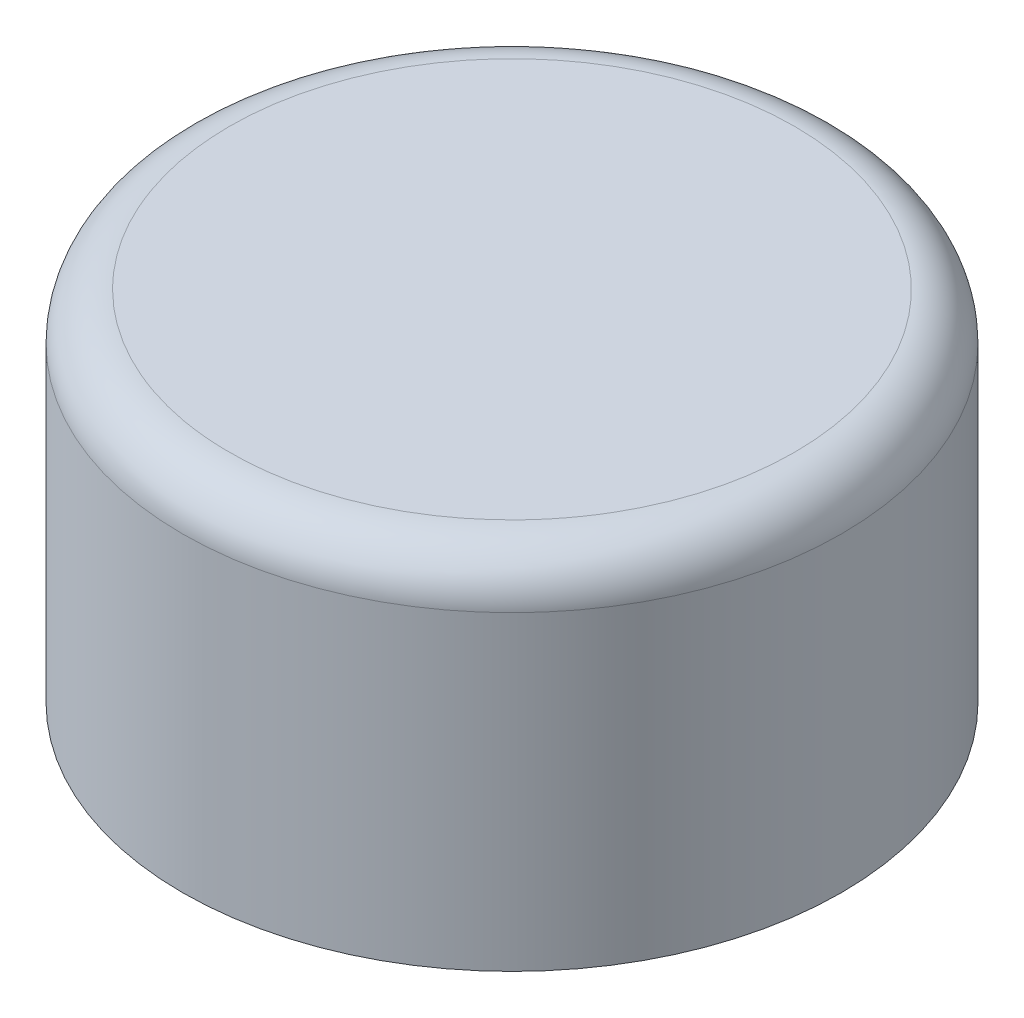
ISO-10303-21;
HEADER;
FILE_DESCRIPTION(('STEP AP214'),'2;1');
FILE_NAME('part.step','',(''),(''),'','','');
FILE_SCHEMA(('AUTOMOTIVE_DESIGN { 1 0 10303 214 1 1 1 1 }'));
ENDSEC;
DATA;
#1=APPLICATION_CONTEXT('core data for automotive mechanical design processes');
#2=APPLICATION_PROTOCOL_DEFINITION('international standard','automotive_design',2000,#1);
#3=PRODUCT_CONTEXT('',#1,'mechanical');
#4=PRODUCT('Part','Part','',(#3));
#5=PRODUCT_RELATED_PRODUCT_CATEGORY('part','',(#4));
#6=PRODUCT_DEFINITION_FORMATION('','',#4);
#7=PRODUCT_DEFINITION_CONTEXT('part definition',#1,'design');
#8=PRODUCT_DEFINITION('design','',#6,#7);
#9=PRODUCT_DEFINITION_SHAPE('','',#8);
#10=(LENGTH_UNIT() NAMED_UNIT(*) SI_UNIT(.MILLI.,.METRE.));
#11=(NAMED_UNIT(*) PLANE_ANGLE_UNIT() SI_UNIT($,.RADIAN.));
#12=(NAMED_UNIT(*) SI_UNIT($,.STERADIAN.) SOLID_ANGLE_UNIT());
#13=UNCERTAINTY_MEASURE_WITH_UNIT(LENGTH_MEASURE(1.E-05),#10,'distance_accuracy_value','');
#14=(GEOMETRIC_REPRESENTATION_CONTEXT(3) GLOBAL_UNCERTAINTY_ASSIGNED_CONTEXT((#13)) GLOBAL_UNIT_ASSIGNED_CONTEXT((#10,
#11,#12)) REPRESENTATION_CONTEXT('',''));
#15=CARTESIAN_POINT('',(0.,0.,0.));
#16=DIRECTION('',(0.,0.,1.));
#17=DIRECTION('',(1.,0.,0.));
#18=AXIS2_PLACEMENT_3D('',#15,#16,#17);
#19=CARTESIAN_POINT('',(0.,5.,0.));
#20=DIRECTION('',(0.,-1.,0.));
#21=DIRECTION('',(0.,0.,-1.));
#22=AXIS2_PLACEMENT_3D('',#19,#20,#21);
#23=PLANE('',#22);
#24=CARTESIAN_POINT('',(0.,5.,0.));
#25=DIRECTION('',(0.,-1.,0.));
#26=DIRECTION('',(0.,0.,-1.));
#27=AXIS2_PLACEMENT_3D('',#24,#25,#26);
#28=CIRCLE('',#27,1.4999999999028);
#29=CARTESIAN_POINT('',(-1.49997879107084,4.99999999997078,0.00732770739517744));
#30=VERTEX_POINT('',#29);
#31=CARTESIAN_POINT('',(1.4999999999028,5.,0.));
#32=VERTEX_POINT('',#31);
#33=EDGE_CURVE('E20',#30,#32,#28,.T.);
#34=ORIENTED_EDGE('',*,*,#33,.F.);
#35=CARTESIAN_POINT('',(1.4999999999028,5.,0.));
#36=CARTESIAN_POINT('',(1.4999739136705,4.99999999775499,0.00884378456866678));
#37=CARTESIAN_POINT('',(1.49988340442,4.99999999667159,0.0176876265319559));
#38=CARTESIAN_POINT('',(1.49953670940759,4.99999999577182,0.0366899934050991));
#39=CARTESIAN_POINT('',(1.49925785148007,4.99999999616824,0.0468481042917275));
#40=CARTESIAN_POINT('',(1.49834987565553,4.99999999740451,0.0709803943600393));
#41=CARTESIAN_POINT('',(1.49762840718503,4.99999999835514,0.0849512123527423));
#42=CARTESIAN_POINT('',(1.4955481793262,4.9999999999058,0.116685759223552));
#43=CARTESIAN_POINT('',(1.49406907692283,5.00000000033881,0.134441619493369));
#44=CARTESIAN_POINT('',(1.49009532146287,4.99999999884369,0.17369791906416));
#45=CARTESIAN_POINT('',(1.48745077339355,4.99999999638841,0.195183464814606));
#46=CARTESIAN_POINT('',(1.48258407675482,4.99999998920163,0.228729933028818));
#47=CARTESIAN_POINT('',(1.48067606586634,4.99999998591892,0.240837447343278));
#48=CARTESIAN_POINT('',(1.47640426017933,4.99999997717876,0.265946015453844));
#49=CARTESIAN_POINT('',(1.47401651056141,4.99999997157152,0.278943027470394));
#50=CARTESIAN_POINT('',(1.46895971972321,4.99999995966831,0.304550254824695));
#51=CARTESIAN_POINT('',(1.46629902821303,4.99999995339264,0.317162129597939));
#52=CARTESIAN_POINT('',(1.45759292964618,4.99999993663513,0.355921266696306));
#53=CARTESIAN_POINT('',(1.45100038678706,4.99999992895004,0.381947686571312));
#54=CARTESIAN_POINT('',(1.43603269748649,4.99999992332872,0.434966114937575));
#55=CARTESIAN_POINT('',(1.42758197182445,4.99999992592706,0.461936816142979));
#56=CARTESIAN_POINT('',(1.41359403171417,4.99999993592611,0.502497710534105));
#57=CARTESIAN_POINT('',(1.40861160977685,4.99999994041429,0.516281494906599));
#58=CARTESIAN_POINT('',(1.3981168190688,4.99999995104066,0.544026256145676));
#59=CARTESIAN_POINT('',(1.39259457572341,4.99999995721599,0.557983503142411));
#60=CARTESIAN_POINT('',(1.37833957728183,4.99999997139283,0.592486345322075));
#61=CARTESIAN_POINT('',(1.36935372197331,4.99999997881772,0.612927932759659));
#62=CARTESIAN_POINT('',(1.35101920448938,4.99999998963772,0.652235458998366));
#63=CARTESIAN_POINT('',(1.34172049918523,4.9999999932386,0.671124750477889));
#64=CARTESIAN_POINT('',(1.32292367852003,4.99999999801061,0.707365137980269));
#65=CARTESIAN_POINT('',(1.31347167107049,4.99999999931558,0.724740150774855));
#66=CARTESIAN_POINT('',(1.29451981012997,5.00000000023577,0.757996898948747));
#67=CARTESIAN_POINT('',(1.2850622355615,4.9999999999544,0.773902742867332));
#68=CARTESIAN_POINT('',(1.26623723313051,4.99999999848274,0.80427196348322));
#69=CARTESIAN_POINT('',(1.25690840014821,4.99999999735633,0.818759274010695));
#70=CARTESIAN_POINT('',(1.23846614828492,4.99999999479189,0.846346074193349));
#71=CARTESIAN_POINT('',(1.22938776532636,4.99999999338304,0.859469000184866));
#72=CARTESIAN_POINT('',(1.21155916980473,4.99999999073176,0.884384053986914));
#73=CARTESIAN_POINT('',(1.20284058194319,4.99999998948503,0.896198811361606));
#74=CARTESIAN_POINT('',(1.18583278994877,4.99999998746657,0.91855468754842));
#75=CARTESIAN_POINT('',(1.17757191415466,4.99999998666304,0.929117406812724));
#76=CARTESIAN_POINT('',(1.15476407901248,4.99999998542083,0.957492857962295));
#77=CARTESIAN_POINT('',(1.13994598512877,4.99999998565388,0.975089068882415));
#78=CARTESIAN_POINT('',(1.11289139761883,4.99999998866762,1.00576648622022));
#79=CARTESIAN_POINT('',(1.10080971509502,4.99999999087282,1.01898476396395));
#80=CARTESIAN_POINT('',(1.07969667871123,4.99999999700459,1.04129598294923));
#81=CARTESIAN_POINT('',(1.07077496863505,5.00000000026328,1.05049307540922));
#82=CARTESIAN_POINT('',(1.0419810903751,4.9999999993838,1.07943872433796));
#83=CARTESIAN_POINT('',(1.02167513671987,4.9999999818831,1.09876007320726));
#84=CARTESIAN_POINT('',(0.980000308048444,4.99999992306451,1.13622210676913));
#85=CARTESIAN_POINT('',(0.958631331285657,4.99999988174434,1.15436267805921));
#86=CARTESIAN_POINT('',(0.914905954789536,4.99999978945125,1.1894160772079));
#87=CARTESIAN_POINT('',(0.892549476301496,4.99999973847755,1.20632880685896));
#88=CARTESIAN_POINT('',(0.846918149668844,4.99999963696817,1.23886949310441));
#89=CARTESIAN_POINT('',(0.823643242934673,4.99999958643252,1.25449736753692));
#90=CARTESIAN_POINT('',(0.77624966256963,4.99999949403211,1.28441916362198));
#91=CARTESIAN_POINT('',(0.752130948575017,4.99999945216776,1.2987130213412));
#92=CARTESIAN_POINT('',(0.703126389473666,4.99999938289085,1.32592089375585));
#93=CARTESIAN_POINT('',(0.678240519914256,4.99999935547875,1.3388348644094));
#94=CARTESIAN_POINT('',(0.627780947260718,4.99999931859478,1.36324177799871));
#95=CARTESIAN_POINT('',(0.602207233225389,4.99999930912318,1.37473469831423));
#96=CARTESIAN_POINT('',(0.550453438193913,4.99999930927178,1.39626282154848));
#97=CARTESIAN_POINT('',(0.524273357243014,4.99999931889198,1.40629802457599));
#98=CARTESIAN_POINT('',(0.47139026297066,4.9999993560561,1.42487875016416));
#99=CARTESIAN_POINT('',(0.444687258056825,4.99999938359974,1.43342429665382));
#100=CARTESIAN_POINT('',(0.390843428166184,4.99999945309804,1.44899847269502));
#101=CARTESIAN_POINT('',(0.363702617251455,4.99999949505224,1.45602715086363));
#102=CARTESIAN_POINT('',(0.309069702056915,4.99999958759634,1.46854547242905));
#103=CARTESIAN_POINT('',(0.281577614718638,4.99999963818583,1.47403518975687));
#104=CARTESIAN_POINT('',(0.226329772777601,4.99999973965885,1.48345755171085));
#105=CARTESIAN_POINT('',(0.198574035173361,4.99999979054237,1.48739029603246));
#106=CARTESIAN_POINT('',(0.14288745525923,4.99999988282749,1.49368894983961));
#107=CARTESIAN_POINT('',(0.114956627142335,4.99999992422984,1.49605498470767));
#108=CARTESIAN_POINT('',(0.0590086237795132,4.99999998211777,1.49920332593353));
#109=CARTESIAN_POINT('',(0.0309914570839333,4.99999999860575,1.49998578436982));
#110=CARTESIAN_POINT('',(-0.0249196797282341,5.00000000132893,1.50000057950012));
#111=CARTESIAN_POINT('',(-0.0528136536359849,4.99999998769592,1.49923966940402));
#112=CARTESIAN_POINT('',(-0.108519122147713,4.99999997716199,1.49623141066465));
#113=CARTESIAN_POINT('',(-0.13633062420049,4.99999998025951,1.49398420064144));
#114=CARTESIAN_POINT('',(-0.191787990634784,5.00000001683366,1.48796393382303));
#115=CARTESIAN_POINT('',(-0.219433852579764,5.00000005031073,1.48419085463822));
#116=CARTESIAN_POINT('',(-0.260734754120541,4.99999985903598,1.47749729241962));
#117=CARTESIAN_POINT('',(-0.274474894916003,4.99999975501032,1.47509353395524));
#118=CARTESIAN_POINT('',(-0.29327409296469,4.99999972167392,1.47144145094677));
#119=CARTESIAN_POINT('',(-0.298375680735801,4.99999972371833,1.47041340883643));
#120=CARTESIAN_POINT('',(-0.319469420016711,4.99999974109624,1.46604289159924));
#121=CARTESIAN_POINT('',(-0.335410678696453,4.99999977550314,1.46245430669114));
#122=CARTESIAN_POINT('',(-0.377784200544204,4.9999998577986,1.45218291038493));
#123=CARTESIAN_POINT('',(-0.40410569270349,4.99999989932355,1.44503531661511));
#124=CARTESIAN_POINT('',(-0.442925054330438,4.99999994528297,1.4333503501686));
#125=CARTESIAN_POINT('',(-0.455588840726849,4.99999995781737,1.42935445779418));
#126=CARTESIAN_POINT('',(-0.479415911573908,4.99999997491252,1.42149183703018));
#127=CARTESIAN_POINT('',(-0.490590547229058,4.99999998020061,1.41765952590665));
#128=CARTESIAN_POINT('',(-0.524648227002614,4.99999999161904,1.40554093797343));
#129=CARTESIAN_POINT('',(-0.547384955752339,4.99999999269924,1.39683987356341));
#130=CARTESIAN_POINT('',(-0.595879799320055,4.99999998209329,1.37694971116727));
#131=CARTESIAN_POINT('',(-0.621565543499133,4.99999996842066,1.36558373643302));
#132=CARTESIAN_POINT('',(-0.672249939123853,4.99999994520107,1.34140813547744));
#133=CARTESIAN_POINT('',(-0.69724856648126,4.99999993565426,1.32859845872439));
#134=CARTESIAN_POINT('',(-0.746484902058807,4.99999992178318,1.30159150810762));
#135=CARTESIAN_POINT('',(-0.770722597212683,4.99999991745899,1.28739421043372));
#136=CARTESIAN_POINT('',(-0.81835774992506,4.99999991657598,1.25765355815255));
#137=CARTESIAN_POINT('',(-0.841755208060824,4.99999992001715,1.24211020447006));
#138=CARTESIAN_POINT('',(-0.887634895543412,4.99999993303164,1.20972789566522));
#139=CARTESIAN_POINT('',(-0.910117141846618,4.99999994260486,1.1928889645631));
#140=CARTESIAN_POINT('',(-0.954095910004533,4.99999996410343,1.15797096571308));
#141=CARTESIAN_POINT('',(-0.975592467695032,4.9999999760287,1.13989194310981));
#142=CARTESIAN_POINT('',(-1.01752483935352,4.99999999380925,1.1025454506291));
#143=CARTESIAN_POINT('',(-1.03796071078851,4.99999999966486,1.08327804526117));
#144=CARTESIAN_POINT('',(-1.07761462540026,5.00000000019069,1.04375516434296));
#145=CARTESIAN_POINT('',(-1.09683909191356,4.99999999492613,1.02350612640806));
#146=CARTESIAN_POINT('',(-1.13416619846927,4.99999999661961,0.982002218005375));
#147=CARTESIAN_POINT('',(-1.15226891261245,5.00000000357683,0.960747414140438));
#148=CARTESIAN_POINT('',(-1.18729245247836,4.99999998819001,0.917282683887671));
#149=CARTESIAN_POINT('',(-1.20421324997402,4.99999996584525,0.895072734709066));
#150=CARTESIAN_POINT('',(-1.22867932580508,4.99999980152132,0.861101212560857));
#151=CARTESIAN_POINT('',(-1.23668279088657,4.99999972493375,0.849666962102897));
#152=CARTESIAN_POINT('',(-1.25240237874926,4.99999953968903,0.826519487468027));
#153=CARTESIAN_POINT('',(-1.26011688542383,4.99999943087522,0.814805163598949));
#154=CARTESIAN_POINT('',(-1.28272502684209,4.99999917180702,0.779323970378536));
#155=CARTESIAN_POINT('',(-1.29708580816889,4.99999908887194,0.755215397429769));
#156=CARTESIAN_POINT('',(-1.32438479360798,4.99999918950636,0.706210694240194));
#157=CARTESIAN_POINT('',(-1.33732328163106,4.99999937302256,0.681314722458178));
#158=CARTESIAN_POINT('',(-1.36157824984572,4.99999975298132,0.630760258894271));
#159=CARTESIAN_POINT('',(-1.37289532986243,4.99999994941906,0.605102053357037));
#160=CARTESIAN_POINT('',(-1.39016497493264,5.0000000304026,0.563592270120509));
#161=CARTESIAN_POINT('',(-1.39646656946412,5.00000000767991,0.547882694039032));
#162=CARTESIAN_POINT('',(-1.40747640200156,4.99999999164281,0.518968454773251));
#163=CARTESIAN_POINT('',(-1.41227231854693,4.99999999394419,0.505797458355174));
#164=CARTESIAN_POINT('',(-1.42287548803951,4.99999999082918,0.475378229306576));
#165=CARTESIAN_POINT('',(-1.42855739746908,4.99999998290446,0.458086303631668));
#166=CARTESIAN_POINT('',(-1.43942025565521,4.99999996359569,0.422874564237595));
#167=CARTESIAN_POINT('',(-1.44458526202887,4.99999995213063,0.404949821168165));
#168=CARTESIAN_POINT('',(-1.45388186777338,4.99999993689331,0.370220269604512));
#169=CARTESIAN_POINT('',(-1.45806118412199,4.99999993262478,0.353428190946356));
#170=CARTESIAN_POINT('',(-1.46485915708759,4.99999990818673,0.324031223760521));
#171=CARTESIAN_POINT('',(-1.46760338065645,4.99999989236967,0.311455404638426));
#172=CARTESIAN_POINT('',(-1.47137971523842,4.99999991182175,0.292762732612731));
#173=CARTESIAN_POINT('',(-1.47256208112324,4.9999999248638,0.286676146287078));
#174=CARTESIAN_POINT('',(-1.47664083559296,4.99999996976935,0.264914510835817));
#175=CARTESIAN_POINT('',(-1.47931201519801,4.99999999901511,0.249197031348218));
#176=CARTESIAN_POINT('',(-1.48552424337488,5.0000000014348,0.208691729149394));
#177=CARTESIAN_POINT('',(-1.48869197197388,4.99999993309329,0.183845623810647));
#178=CARTESIAN_POINT('',(-1.49253494298719,4.99999975859396,0.146448297561485));
#179=CARTESIAN_POINT('',(-1.49366554556845,4.99999968826368,0.133941574681328));
#180=CARTESIAN_POINT('',(-1.4955757480982,4.99999961395013,0.109834703885917));
#181=CARTESIAN_POINT('',(-1.49637516387423,4.99999960543231,0.0982361255402458));
#182=CARTESIAN_POINT('',(-1.49861559289687,4.99999965039932,0.0602238886097999));
#183=CARTESIAN_POINT('',(-1.49957462958497,4.99999979681204,0.0337808352109314));
#184=CARTESIAN_POINT('',(-1.49997767938116,4.99999999996104,0.00732939135639209));
#185=B_SPLINE_CURVE_WITH_KNOTS('',3,(#35,#36,#37,#38,#39,#40,#41,#42,#43,#44,#45,#46,#47,#48,
#49,#50,#51,#52,#53,#54,#55,#56,#57,#58,#59,#60,#61,#62,#63,#64,#65,#66,#67,#68,#69,#70,#71,#72,
#73,#74,#75,#76,#77,#78,#79,#80,#81,#82,#83,#84,#85,#86,#87,#88,#89,#90,#91,#92,#93,#94,#95,#96,
#97,#98,#99,#100,#101,#102,#103,#104,#105,#106,#107,#108,#109,#110,#111,#112,#113,#114,#115,
#116,#117,#118,#119,#120,#121,#122,#123,#124,#125,#126,#127,#128,#129,#130,#131,#132,#133,#134,
#135,#136,#137,#138,#139,#140,#141,#142,#143,#144,#145,#146,#147,#148,#149,#150,#151,#152,#153,
#154,#155,#156,#157,#158,#159,#160,#161,#162,#163,#164,#165,#166,#167,#168,#169,#170,#171,#172,
#173,#174,#175,#176,#177,#178,#179,#180,#181,#182,#183,#184),.UNSPECIFIED.,.F.,.F.,(4,2,2,2,2,2,
2,2,2,2,2,2,2,2,2,2,2,2,2,2,2,2,2,2,2,2,2,2,2,2,2,2,2,2,2,2,2,2,2,2,2,2,2,2,2,2,2,2,2,2,2,2,2,2,
2,2,2,2,2,2,2,2,2,2,2,2,2,2,2,2,2,2,2,2,4),(0.,0.0265316309193228,0.0570156640726255,
0.0989783339117684,0.152419768109412,0.217340295477175,0.254108111866091,0.293746613556372,
0.332411502841202,0.412914914300458,0.497656816993961,0.541621248792508,0.586644722318733,
0.653609443453896,0.716753226486049,0.776076428477323,0.831579368181555,0.88326232605207,
0.931125544253916,0.975169226682711,1.01539353899375,1.08438004650073,1.13809251369389,
1.17652985545699,1.26056974836664,1.34461770063798,1.4286723680016,1.51273240618529,
1.59679647091567,1.68086321791919,1.76493130292253,1.84899938165258,1.93306610983626,
2.0171301432004,2.10119013747167,2.18524474837706,2.26929263164477,2.35333244300596,
2.43700532056554,2.52067039545826,2.60433669804308,2.64617693052539,2.66178891260078,
2.71080121562519,2.79257816419399,2.83241222039034,2.86784995134433,2.94085584015459,
3.02507596409922,3.10929903679034,3.19352355491857,3.2777480151813,3.36197091428342,
3.44619074893791,3.53040601586669,3.61412876047873,3.69784596862265,3.78156517545694,
3.82343173198961,3.86550526038604,3.9496394353005,4.033756785175,4.11784293580274,
4.16861650956493,4.21066123917315,4.2652540606735,4.32120245455859,4.37310565506526,
4.41171570265771,4.43031624687555,4.47813649055957,4.55324237047182,4.59091287692052,
4.62578902880311,4.70514383323906),.UNSPECIFIED.);
#186=EDGE_CURVE('E33',#32,#30,#185,.T.);
#187=ORIENTED_EDGE('',*,*,#186,.F.);
#188=EDGE_LOOP('',(#34,#187));
#189=FACE_BOUND('',#188,.T.);
#190=ADVANCED_FACE('F16',(#189),#23,.F.);
#191=CARTESIAN_POINT('',(0.,4.75,0.));
#192=DIRECTION('',(0.,-1.,0.));
#193=DIRECTION('',(0.,0.,-1.));
#194=AXIS2_PLACEMENT_3D('',#191,#192,#193);
#195=TOROIDAL_SURFACE('',#194,1.5,0.25);
#196=CARTESIAN_POINT('',(0.,4.75,0.));
#197=DIRECTION('',(0.,-1.,0.));
#198=DIRECTION('',(0.,0.,-1.));
#199=AXIS2_PLACEMENT_3D('',#196,#197,#198);
#200=CIRCLE('',#199,1.75);
#201=CARTESIAN_POINT('',(0.,4.75,-1.75));
#202=VERTEX_POINT('',#201);
#203=EDGE_CURVE('E25',#202,#202,#200,.T.);
#204=ORIENTED_EDGE('',*,*,#203,.F.);
#205=EDGE_LOOP('',(#204));
#206=FACE_BOUND('',#205,.T.);
#207=ORIENTED_EDGE('',*,*,#186,.T.);
#208=ORIENTED_EDGE('',*,*,#33,.T.);
#209=EDGE_LOOP('',(#207,#208));
#210=FACE_BOUND('',#209,.T.);
#211=ADVANCED_FACE('F18',(#206,#210),#195,.T.);
#212=CARTESIAN_POINT('',(0.,5.095,0.));
#213=DIRECTION('',(0.,-1.,0.));
#214=DIRECTION('',(0.,0.,-1.));
#215=AXIS2_PLACEMENT_3D('',#212,#213,#214);
#216=CYLINDRICAL_SURFACE('',#215,1.75);
#217=ORIENTED_EDGE('',*,*,#203,.T.);
#218=EDGE_LOOP('',(#217));
#219=FACE_BOUND('',#218,.T.);
#220=CARTESIAN_POINT('',(0.,3.1,0.));
#221=DIRECTION('',(0.,-1.,0.));
#222=DIRECTION('',(0.,0.,-1.));
#223=AXIS2_PLACEMENT_3D('',#220,#221,#222);
#224=CIRCLE('',#223,1.75);
#225=CARTESIAN_POINT('',(0.,3.1,-1.75));
#226=VERTEX_POINT('',#225);
#227=EDGE_CURVE('E11',#226,#226,#224,.T.);
#228=ORIENTED_EDGE('',*,*,#227,.F.);
#229=EDGE_LOOP('',(#228));
#230=FACE_BOUND('',#229,.T.);
#231=ADVANCED_FACE('F46',(#219,#230),#216,.T.);
#232=CARTESIAN_POINT('',(0.,3.1,0.));
#233=DIRECTION('',(0.,-1.,0.));
#234=DIRECTION('',(0.,0.,-1.));
#235=AXIS2_PLACEMENT_3D('',#232,#233,#234);
#236=PLANE('',#235);
#237=ORIENTED_EDGE('',*,*,#227,.T.);
#238=EDGE_LOOP('',(#237));
#239=FACE_BOUND('',#238,.T.);
#240=ADVANCED_FACE('F49',(#239),#236,.T.);
#241=CLOSED_SHELL('',(#190,#211,#231,#240));
#242=MANIFOLD_SOLID_BREP('B1',#241);
#243=ADVANCED_BREP_SHAPE_REPRESENTATION('',(#18,#242),#14);
#244=SHAPE_DEFINITION_REPRESENTATION(#9,#243);
ENDSEC;
END-ISO-10303-21;
